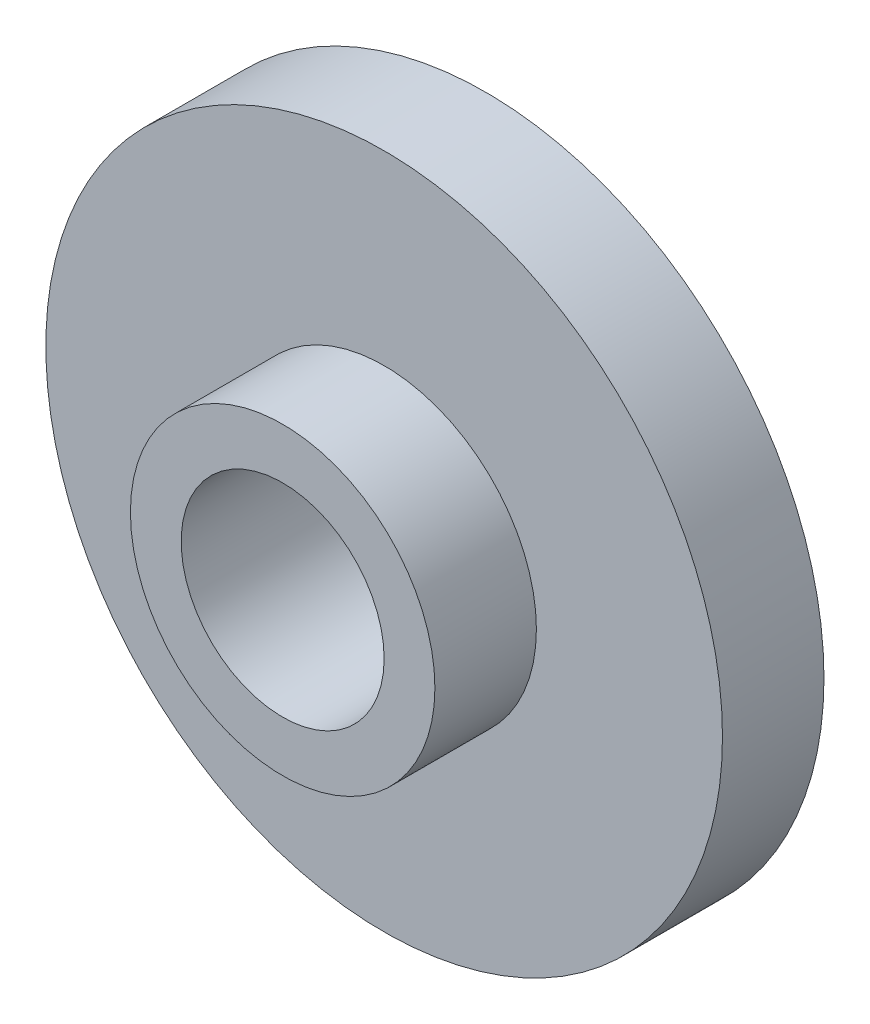
ISO-10303-21;
HEADER;
FILE_DESCRIPTION(('STEP AP214'),'2;1');
FILE_NAME('part.step','',(''),(''),'','','');
FILE_SCHEMA(('AUTOMOTIVE_DESIGN { 1 0 10303 214 1 1 1 1 }'));
ENDSEC;
DATA;
#1=APPLICATION_CONTEXT('core data for automotive mechanical design processes');
#2=APPLICATION_PROTOCOL_DEFINITION('international standard','automotive_design',2000,#1);
#3=PRODUCT_CONTEXT('',#1,'mechanical');
#4=PRODUCT('Part','Part','',(#3));
#5=PRODUCT_RELATED_PRODUCT_CATEGORY('part','',(#4));
#6=PRODUCT_DEFINITION_FORMATION('','',#4);
#7=PRODUCT_DEFINITION_CONTEXT('part definition',#1,'design');
#8=PRODUCT_DEFINITION('design','',#6,#7);
#9=PRODUCT_DEFINITION_SHAPE('','',#8);
#10=(LENGTH_UNIT() NAMED_UNIT(*) SI_UNIT(.MILLI.,.METRE.));
#11=(NAMED_UNIT(*) PLANE_ANGLE_UNIT() SI_UNIT($,.RADIAN.));
#12=(NAMED_UNIT(*) SI_UNIT($,.STERADIAN.) SOLID_ANGLE_UNIT());
#13=UNCERTAINTY_MEASURE_WITH_UNIT(LENGTH_MEASURE(1.E-05),#10,'distance_accuracy_value','');
#14=(GEOMETRIC_REPRESENTATION_CONTEXT(3) GLOBAL_UNCERTAINTY_ASSIGNED_CONTEXT((#13)) GLOBAL_UNIT_ASSIGNED_CONTEXT((#10,
#11,#12)) REPRESENTATION_CONTEXT('',''));
#15=CARTESIAN_POINT('',(0.,0.,0.));
#16=DIRECTION('',(0.,0.,1.));
#17=DIRECTION('',(1.,0.,0.));
#18=AXIS2_PLACEMENT_3D('',#15,#16,#17);
#19=CARTESIAN_POINT('',(0.,0.,3.));
#20=DIRECTION('',(0.,0.,1.));
#21=DIRECTION('',(1.,0.,0.));
#22=AXIS2_PLACEMENT_3D('',#19,#20,#21);
#23=PLANE('',#22);
#24=CARTESIAN_POINT('',(0.,0.,3.));
#25=DIRECTION('',(0.,0.,1.));
#26=DIRECTION('',(1.,0.,0.));
#27=AXIS2_PLACEMENT_3D('',#24,#25,#26);
#28=CIRCLE('',#27,10.);
#29=CARTESIAN_POINT('',(10.,0.,3.));
#30=VERTEX_POINT('',#29);
#31=EDGE_CURVE('E10',#30,#30,#28,.T.);
#32=ORIENTED_EDGE('',*,*,#31,.T.);
#33=EDGE_LOOP('',(#32));
#34=FACE_BOUND('',#33,.T.);
#35=CARTESIAN_POINT('',(0.,0.,3.));
#36=DIRECTION('',(0.,0.,1.));
#37=DIRECTION('',(1.,0.,0.));
#38=AXIS2_PLACEMENT_3D('',#35,#36,#37);
#39=CIRCLE('',#38,4.5);
#40=CARTESIAN_POINT('',(4.5,0.,3.));
#41=VERTEX_POINT('',#40);
#42=EDGE_CURVE('E47',#41,#41,#39,.T.);
#43=ORIENTED_EDGE('',*,*,#42,.F.);
#44=EDGE_LOOP('',(#43));
#45=FACE_BOUND('',#44,.T.);
#46=ADVANCED_FACE('F31',(#34,#45),#23,.T.);
#47=CARTESIAN_POINT('',(0.,0.,0.));
#48=DIRECTION('',(0.,0.,1.));
#49=DIRECTION('',(1.,0.,0.));
#50=AXIS2_PLACEMENT_3D('',#47,#48,#49);
#51=PLANE('',#50);
#52=CARTESIAN_POINT('',(0.,0.,0.));
#53=DIRECTION('',(0.,0.,1.));
#54=DIRECTION('',(1.,0.,0.));
#55=AXIS2_PLACEMENT_3D('',#52,#53,#54);
#56=CIRCLE('',#55,10.);
#57=CARTESIAN_POINT('',(10.,0.,0.));
#58=VERTEX_POINT('',#57);
#59=EDGE_CURVE('E35',#58,#58,#56,.T.);
#60=ORIENTED_EDGE('',*,*,#59,.F.);
#61=EDGE_LOOP('',(#60));
#62=FACE_BOUND('',#61,.T.);
#63=CARTESIAN_POINT('',(0.,0.,0.));
#64=DIRECTION('',(0.,0.,1.));
#65=DIRECTION('',(1.,0.,0.));
#66=AXIS2_PLACEMENT_3D('',#63,#64,#65);
#67=CIRCLE('',#66,3.);
#68=CARTESIAN_POINT('',(3.,0.,0.));
#69=VERTEX_POINT('',#68);
#70=EDGE_CURVE('E42',#69,#69,#67,.T.);
#71=ORIENTED_EDGE('',*,*,#70,.T.);
#72=EDGE_LOOP('',(#71));
#73=FACE_BOUND('',#72,.T.);
#74=ADVANCED_FACE('F72',(#62,#73),#51,.F.);
#75=CARTESIAN_POINT('',(0.,0.,3.));
#76=DIRECTION('',(0.,0.,-1.));
#77=DIRECTION('',(-1.,0.,0.));
#78=AXIS2_PLACEMENT_3D('',#75,#76,#77);
#79=CYLINDRICAL_SURFACE('',#78,10.);
#80=ORIENTED_EDGE('',*,*,#31,.F.);
#81=EDGE_LOOP('',(#80));
#82=FACE_BOUND('',#81,.T.);
#83=ORIENTED_EDGE('',*,*,#59,.T.);
#84=EDGE_LOOP('',(#83));
#85=FACE_BOUND('',#84,.T.);
#86=ADVANCED_FACE('F33',(#82,#85),#79,.T.);
#87=CARTESIAN_POINT('',(0.,0.,3.));
#88=DIRECTION('',(0.,0.,-1.));
#89=DIRECTION('',(-1.,0.,0.));
#90=AXIS2_PLACEMENT_3D('',#87,#88,#89);
#91=CYLINDRICAL_SURFACE('',#90,3.);
#92=ORIENTED_EDGE('',*,*,#70,.F.);
#93=EDGE_LOOP('',(#92));
#94=FACE_BOUND('',#93,.T.);
#95=CARTESIAN_POINT('',(0.,0.,6.));
#96=DIRECTION('',(0.,0.,1.));
#97=DIRECTION('',(1.,0.,0.));
#98=AXIS2_PLACEMENT_3D('',#95,#96,#97);
#99=CIRCLE('',#98,3.);
#100=CARTESIAN_POINT('',(3.,0.,6.));
#101=VERTEX_POINT('',#100);
#102=EDGE_CURVE('E50',#101,#101,#99,.T.);
#103=ORIENTED_EDGE('',*,*,#102,.T.);
#104=EDGE_LOOP('',(#103));
#105=FACE_BOUND('',#104,.T.);
#106=ADVANCED_FACE('F56',(#94,#105),#91,.F.);
#107=CARTESIAN_POINT('',(0.,0.,6.));
#108=DIRECTION('',(0.,0.,1.));
#109=DIRECTION('',(1.,0.,0.));
#110=AXIS2_PLACEMENT_3D('',#107,#108,#109);
#111=PLANE('',#110);
#112=CARTESIAN_POINT('',(0.,0.,6.));
#113=DIRECTION('',(0.,0.,1.));
#114=DIRECTION('',(1.,0.,0.));
#115=AXIS2_PLACEMENT_3D('',#112,#113,#114);
#116=CIRCLE('',#115,4.5);
#117=CARTESIAN_POINT('',(4.5,0.,6.));
#118=VERTEX_POINT('',#117);
#119=EDGE_CURVE('E46',#118,#118,#116,.T.);
#120=ORIENTED_EDGE('',*,*,#119,.T.);
#121=EDGE_LOOP('',(#120));
#122=FACE_BOUND('',#121,.T.);
#123=ORIENTED_EDGE('',*,*,#102,.F.);
#124=EDGE_LOOP('',(#123));
#125=FACE_BOUND('',#124,.T.);
#126=ADVANCED_FACE('F58',(#122,#125),#111,.T.);
#127=CARTESIAN_POINT('',(0.,0.,6.));
#128=DIRECTION('',(0.,0.,-1.));
#129=DIRECTION('',(-1.,0.,0.));
#130=AXIS2_PLACEMENT_3D('',#127,#128,#129);
#131=CYLINDRICAL_SURFACE('',#130,4.5);
#132=ORIENTED_EDGE('',*,*,#119,.F.);
#133=EDGE_LOOP('',(#132));
#134=FACE_BOUND('',#133,.T.);
#135=ORIENTED_EDGE('',*,*,#42,.T.);
#136=EDGE_LOOP('',(#135));
#137=FACE_BOUND('',#136,.T.);
#138=ADVANCED_FACE('F60',(#134,#137),#131,.T.);
#139=CLOSED_SHELL('',(#46,#74,#86,#106,#126,#138));
#140=MANIFOLD_SOLID_BREP('B2',#139);
#141=ADVANCED_BREP_SHAPE_REPRESENTATION('',(#18,#140),#14);
#142=SHAPE_DEFINITION_REPRESENTATION(#9,#141);
ENDSEC;
END-ISO-10303-21;
